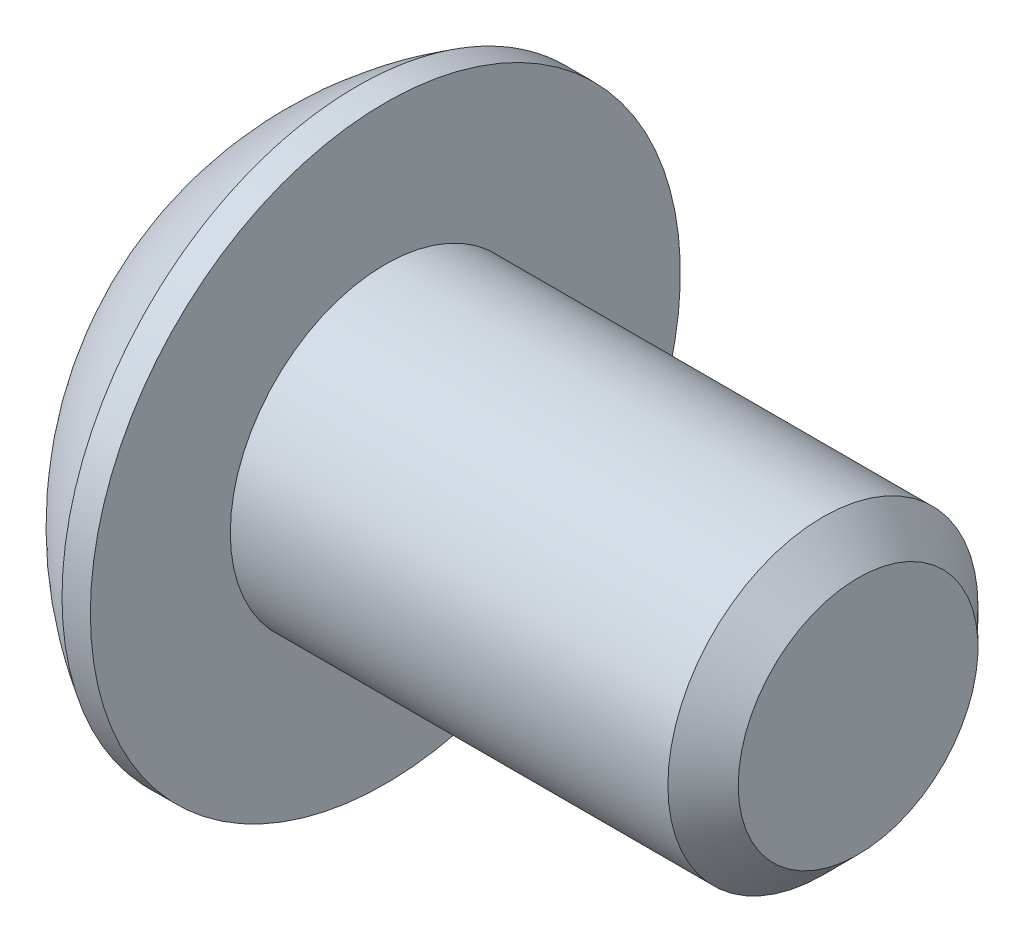
ISO-10303-21;
HEADER;
FILE_DESCRIPTION(('STEP AP214'),'2;1');
FILE_NAME('part.step','',(''),(''),'','','');
FILE_SCHEMA(('AUTOMOTIVE_DESIGN { 1 0 10303 214 1 1 1 1 }'));
ENDSEC;
DATA;
#1=APPLICATION_CONTEXT('core data for automotive mechanical design processes');
#2=APPLICATION_PROTOCOL_DEFINITION('international standard','automotive_design',2000,#1);
#3=PRODUCT_CONTEXT('',#1,'mechanical');
#4=PRODUCT('Part','Part','',(#3));
#5=PRODUCT_RELATED_PRODUCT_CATEGORY('part','',(#4));
#6=PRODUCT_DEFINITION_FORMATION('','',#4);
#7=PRODUCT_DEFINITION_CONTEXT('part definition',#1,'design');
#8=PRODUCT_DEFINITION('design','',#6,#7);
#9=PRODUCT_DEFINITION_SHAPE('','',#8);
#10=(LENGTH_UNIT() NAMED_UNIT(*) SI_UNIT(.MILLI.,.METRE.));
#11=(NAMED_UNIT(*) PLANE_ANGLE_UNIT() SI_UNIT($,.RADIAN.));
#12=(NAMED_UNIT(*) SI_UNIT($,.STERADIAN.) SOLID_ANGLE_UNIT());
#13=UNCERTAINTY_MEASURE_WITH_UNIT(LENGTH_MEASURE(1.E-05),#10,'distance_accuracy_value','');
#14=(GEOMETRIC_REPRESENTATION_CONTEXT(3) GLOBAL_UNCERTAINTY_ASSIGNED_CONTEXT((#13)) GLOBAL_UNIT_ASSIGNED_CONTEXT((#10,
#11,#12)) REPRESENTATION_CONTEXT('',''));
#15=CARTESIAN_POINT('',(0.,0.,0.));
#16=DIRECTION('',(0.,0.,1.));
#17=DIRECTION('',(1.,0.,0.));
#18=AXIS2_PLACEMENT_3D('',#15,#16,#17);
#19=CARTESIAN_POINT('',(1.32080000000034,0.,0.));
#20=DIRECTION('',(-1.,0.,0.));
#21=DIRECTION('',(0.,0.,1.));
#22=AXIS2_PLACEMENT_3D('',#19,#20,#21);
#23=CONICAL_SURFACE('',#22,1.1937999999998,1.04719755119608);
#24=CARTESIAN_POINT('',(2.01004075135902,0.,4.44089209850063E-13));
#25=VERTEX_POINT('',#24);
#26=VERTEX_LOOP('',#25);
#27=FACE_BOUND('',#26,.T.);
#28=CARTESIAN_POINT('',(1.32080000000009,0.,0.));
#29=DIRECTION('',(-1.,0.,0.));
#30=DIRECTION('',(0.,0.,1.));
#31=AXIS2_PLACEMENT_3D('',#28,#29,#30);
#32=CIRCLE('',#31,1.19380000000024);
#33=CARTESIAN_POINT('',(1.32080000000004,-1.03386112703797,0.59690000000006));
#34=VERTEX_POINT('',#33);
#35=CARTESIAN_POINT('',(1.32080000000004,0.,1.19380000000012));
#36=VERTEX_POINT('',#35);
#37=EDGE_CURVE('E19',#34,#36,#32,.T.);
#38=ORIENTED_EDGE('',*,*,#37,.T.);
#39=CARTESIAN_POINT('',(1.32080000000009,0.,0.));
#40=DIRECTION('',(-1.,0.,0.));
#41=DIRECTION('',(0.,0.,1.));
#42=AXIS2_PLACEMENT_3D('',#39,#40,#41);
#43=CIRCLE('',#42,1.19380000000024);
#44=CARTESIAN_POINT('',(1.32080000000004,1.03386112703797,0.596900000000061));
#45=VERTEX_POINT('',#44);
#46=EDGE_CURVE('E147',#36,#45,#43,.T.);
#47=ORIENTED_EDGE('',*,*,#46,.T.);
#48=CARTESIAN_POINT('',(1.32080000000009,0.,0.));
#49=DIRECTION('',(-1.,0.,0.));
#50=DIRECTION('',(0.,0.,1.));
#51=AXIS2_PLACEMENT_3D('',#48,#49,#50);
#52=CIRCLE('',#51,1.19380000000024);
#53=CARTESIAN_POINT('',(1.32080000000004,1.03386112703797,-0.596900000000061));
#54=VERTEX_POINT('',#53);
#55=EDGE_CURVE('E402',#45,#54,#52,.T.);
#56=ORIENTED_EDGE('',*,*,#55,.T.);
#57=CARTESIAN_POINT('',(1.32080000000009,0.,0.));
#58=DIRECTION('',(-1.,0.,0.));
#59=DIRECTION('',(0.,0.,1.));
#60=AXIS2_PLACEMENT_3D('',#57,#58,#59);
#61=CIRCLE('',#60,1.19380000000024);
#62=CARTESIAN_POINT('',(1.32080000000004,1.49457637585666E-12,-1.19380000000012));
#63=VERTEX_POINT('',#62);
#64=EDGE_CURVE('E403',#54,#63,#61,.T.);
#65=ORIENTED_EDGE('',*,*,#64,.T.);
#66=CARTESIAN_POINT('',(1.32080000000009,0.,0.));
#67=DIRECTION('',(-1.,0.,0.));
#68=DIRECTION('',(0.,0.,1.));
#69=AXIS2_PLACEMENT_3D('',#66,#67,#68);
#70=CIRCLE('',#69,1.19380000000024);
#71=CARTESIAN_POINT('',(1.32080000000004,-1.03386112703797,-0.59690000000006));
#72=VERTEX_POINT('',#71);
#73=EDGE_CURVE('E92',#63,#72,#70,.T.);
#74=ORIENTED_EDGE('',*,*,#73,.T.);
#75=CARTESIAN_POINT('',(1.32080000000009,0.,0.));
#76=DIRECTION('',(-1.,0.,0.));
#77=DIRECTION('',(0.,0.,1.));
#78=AXIS2_PLACEMENT_3D('',#75,#76,#77);
#79=CIRCLE('',#78,1.19380000000024);
#80=EDGE_CURVE('E88',#72,#34,#79,.T.);
#81=ORIENTED_EDGE('',*,*,#80,.T.);
#82=EDGE_LOOP('',(#38,#47,#56,#65,#74,#81));
#83=FACE_BOUND('',#82,.T.);
#84=ADVANCED_FACE('F16',(#27,#83),#23,.F.);
#85=CARTESIAN_POINT('',(1.3208,-2.06772225407572,-1.1938));
#86=DIRECTION('',(1.,0.,0.));
#87=DIRECTION('',(0.,0.,-1.));
#88=AXIS2_PLACEMENT_3D('',#85,#86,#87);
#89=PLANE('',#88);
#90=DIRECTION('',(0.,0.5,0.866025403784439));
#91=VECTOR('',#90,1.);
#92=CARTESIAN_POINT('',(1.3208,-1.37848150271715,0.));
#93=LINE('',#92,#91);
#94=CARTESIAN_POINT('',(1.3208,-0.689240751358574,1.1938));
#95=VERTEX_POINT('',#94);
#96=EDGE_CURVE('E100',#95,#34,#93,.F.);
#97=ORIENTED_EDGE('',*,*,#96,.F.);
#98=DIRECTION('',(0.,1.,0.));
#99=VECTOR('',#98,1.);
#100=CARTESIAN_POINT('',(1.3208,-0.689240751358574,1.1938));
#101=LINE('',#100,#99);
#102=EDGE_CURVE('E102',#36,#95,#101,.F.);
#103=ORIENTED_EDGE('',*,*,#102,.F.);
#104=ORIENTED_EDGE('',*,*,#37,.F.);
#105=EDGE_LOOP('',(#97,#103,#104));
#106=FACE_BOUND('',#105,.T.);
#107=ADVANCED_FACE('F98',(#106),#89,.F.);
#108=CARTESIAN_POINT('',(1.3208,-2.06772225407572,-1.1938));
#109=DIRECTION('',(1.,0.,0.));
#110=DIRECTION('',(0.,0.,-1.));
#111=AXIS2_PLACEMENT_3D('',#108,#109,#110);
#112=PLANE('',#111);
#113=DIRECTION('',(0.,-0.5,0.866025403784439));
#114=VECTOR('',#113,1.);
#115=CARTESIAN_POINT('',(1.3208,-0.689240751358574,-1.1938));
#116=LINE('',#115,#114);
#117=CARTESIAN_POINT('',(1.3208,-1.37848150271715,0.));
#118=VERTEX_POINT('',#117);
#119=EDGE_CURVE('E108',#118,#72,#116,.F.);
#120=ORIENTED_EDGE('',*,*,#119,.F.);
#121=DIRECTION('',(0.,0.5,0.866025403784439));
#122=VECTOR('',#121,1.);
#123=CARTESIAN_POINT('',(1.3208,-1.37848150271715,0.));
#124=LINE('',#123,#122);
#125=EDGE_CURVE('E105',#34,#118,#124,.F.);
#126=ORIENTED_EDGE('',*,*,#125,.F.);
#127=ORIENTED_EDGE('',*,*,#80,.F.);
#128=EDGE_LOOP('',(#120,#126,#127));
#129=FACE_BOUND('',#128,.T.);
#130=ADVANCED_FACE('F106',(#129),#112,.F.);
#131=CARTESIAN_POINT('',(1.3208,-2.06772225407572,-1.1938));
#132=DIRECTION('',(1.,0.,0.));
#133=DIRECTION('',(0.,0.,-1.));
#134=AXIS2_PLACEMENT_3D('',#131,#132,#133);
#135=PLANE('',#134);
#136=DIRECTION('',(0.,1.,0.));
#137=VECTOR('',#136,1.);
#138=CARTESIAN_POINT('',(1.3208,0.689240751358577,-1.1938));
#139=LINE('',#138,#137);
#140=CARTESIAN_POINT('',(1.3208,-0.689240751358574,-1.1938));
#141=VERTEX_POINT('',#140);
#142=EDGE_CURVE('E373',#141,#63,#139,.T.);
#143=ORIENTED_EDGE('',*,*,#142,.F.);
#144=DIRECTION('',(0.,-0.5,0.866025403784439));
#145=VECTOR('',#144,1.);
#146=CARTESIAN_POINT('',(1.3208,-0.689240751358574,-1.1938));
#147=LINE('',#146,#145);
#148=EDGE_CURVE('E385',#72,#141,#147,.F.);
#149=ORIENTED_EDGE('',*,*,#148,.F.);
#150=ORIENTED_EDGE('',*,*,#73,.F.);
#151=EDGE_LOOP('',(#143,#149,#150));
#152=FACE_BOUND('',#151,.T.);
#153=ADVANCED_FACE('F190',(#152),#135,.F.);
#154=CARTESIAN_POINT('',(1.3208,-2.06772225407572,-1.1938));
#155=DIRECTION('',(1.,0.,0.));
#156=DIRECTION('',(0.,0.,-1.));
#157=AXIS2_PLACEMENT_3D('',#154,#155,#156);
#158=PLANE('',#157);
#159=DIRECTION('',(0.,-0.5,-0.866025403784439));
#160=VECTOR('',#159,1.);
#161=CARTESIAN_POINT('',(1.3208,1.37848150271715,0.));
#162=LINE('',#161,#160);
#163=CARTESIAN_POINT('',(1.3208,0.689240751358577,-1.1938));
#164=VERTEX_POINT('',#163);
#165=EDGE_CURVE('E359',#164,#54,#162,.F.);
#166=ORIENTED_EDGE('',*,*,#165,.F.);
#167=DIRECTION('',(0.,1.,0.));
#168=VECTOR('',#167,1.);
#169=CARTESIAN_POINT('',(1.3208,0.689240751358577,-1.1938));
#170=LINE('',#169,#168);
#171=EDGE_CURVE('E370',#63,#164,#170,.T.);
#172=ORIENTED_EDGE('',*,*,#171,.F.);
#173=ORIENTED_EDGE('',*,*,#64,.F.);
#174=EDGE_LOOP('',(#166,#172,#173));
#175=FACE_BOUND('',#174,.T.);
#176=ADVANCED_FACE('F186',(#175),#158,.F.);
#177=CARTESIAN_POINT('',(1.3208,-2.06772225407572,-1.1938));
#178=DIRECTION('',(1.,0.,0.));
#179=DIRECTION('',(0.,0.,-1.));
#180=AXIS2_PLACEMENT_3D('',#177,#178,#179);
#181=PLANE('',#180);
#182=DIRECTION('',(0.,0.5,-0.866025403784439));
#183=VECTOR('',#182,1.);
#184=CARTESIAN_POINT('',(1.3208,0.689240751358576,1.1938));
#185=LINE('',#184,#183);
#186=CARTESIAN_POINT('',(1.3208,1.37848150271715,0.));
#187=VERTEX_POINT('',#186);
#188=EDGE_CURVE('E338',#187,#45,#185,.F.);
#189=ORIENTED_EDGE('',*,*,#188,.F.);
#190=DIRECTION('',(0.,-0.5,-0.866025403784439));
#191=VECTOR('',#190,1.);
#192=CARTESIAN_POINT('',(1.3208,1.37848150271715,0.));
#193=LINE('',#192,#191);
#194=EDGE_CURVE('E357',#54,#187,#193,.F.);
#195=ORIENTED_EDGE('',*,*,#194,.F.);
#196=ORIENTED_EDGE('',*,*,#55,.F.);
#197=EDGE_LOOP('',(#189,#195,#196));
#198=FACE_BOUND('',#197,.T.);
#199=ADVANCED_FACE('F182',(#198),#181,.F.);
#200=CARTESIAN_POINT('',(1.3208,-2.06772225407572,-1.1938));
#201=DIRECTION('',(1.,0.,0.));
#202=DIRECTION('',(0.,0.,-1.));
#203=AXIS2_PLACEMENT_3D('',#200,#201,#202);
#204=PLANE('',#203);
#205=DIRECTION('',(0.,1.,0.));
#206=VECTOR('',#205,1.);
#207=CARTESIAN_POINT('',(1.3208,-0.689240751358574,1.1938));
#208=LINE('',#207,#206);
#209=CARTESIAN_POINT('',(1.3208,0.689240751358576,1.1938));
#210=VERTEX_POINT('',#209);
#211=EDGE_CURVE('E117',#210,#36,#208,.F.);
#212=ORIENTED_EDGE('',*,*,#211,.F.);
#213=DIRECTION('',(0.,0.5,-0.866025403784439));
#214=VECTOR('',#213,1.);
#215=CARTESIAN_POINT('',(1.3208,0.689240751358576,1.1938));
#216=LINE('',#215,#214);
#217=EDGE_CURVE('E341',#45,#210,#216,.F.);
#218=ORIENTED_EDGE('',*,*,#217,.F.);
#219=ORIENTED_EDGE('',*,*,#46,.F.);
#220=EDGE_LOOP('',(#212,#218,#219));
#221=FACE_BOUND('',#220,.T.);
#222=ADVANCED_FACE('F178',(#221),#204,.F.);
#223=CARTESIAN_POINT('',(1.3208,-0.689240751358574,1.1938));
#224=DIRECTION('',(0.,0.,-1.));
#225=DIRECTION('',(0.,1.,0.));
#226=AXIS2_PLACEMENT_3D('',#223,#224,#225);
#227=PLANE('',#226);
#228=DIRECTION('',(0.,1.,0.));
#229=VECTOR('',#228,1.);
#230=CARTESIAN_POINT('',(0.,0.,1.1938));
#231=LINE('',#230,#229);
#232=CARTESIAN_POINT('',(0.,0.689240751358577,1.1938));
#233=VERTEX_POINT('',#232);
#234=CARTESIAN_POINT('',(0.,-0.689240751358574,1.1938));
#235=VERTEX_POINT('',#234);
#236=EDGE_CURVE('E335',#233,#235,#231,.F.);
#237=ORIENTED_EDGE('',*,*,#236,.F.);
#238=DIRECTION('',(1.,0.,0.));
#239=VECTOR('',#238,1.);
#240=CARTESIAN_POINT('',(1.3208,0.689240751358576,1.1938));
#241=LINE('',#240,#239);
#242=EDGE_CURVE('E347',#210,#233,#241,.F.);
#243=ORIENTED_EDGE('',*,*,#242,.F.);
#244=ORIENTED_EDGE('',*,*,#211,.T.);
#245=ORIENTED_EDGE('',*,*,#102,.T.);
#246=DIRECTION('',(1.,0.,0.));
#247=VECTOR('',#246,1.);
#248=CARTESIAN_POINT('',(1.3208,-0.689240751358574,1.1938));
#249=LINE('',#248,#247);
#250=EDGE_CURVE('E111',#235,#95,#249,.T.);
#251=ORIENTED_EDGE('',*,*,#250,.F.);
#252=EDGE_LOOP('',(#237,#243,#244,#245,#251));
#253=FACE_BOUND('',#252,.T.);
#254=ADVANCED_FACE('F175',(#253),#227,.T.);
#255=CARTESIAN_POINT('',(1.3208,-1.37848150271715,0.));
#256=DIRECTION('',(0.,0.866025403784439,-0.5));
#257=DIRECTION('',(0.,0.5,0.866025403784439));
#258=AXIS2_PLACEMENT_3D('',#255,#256,#257);
#259=PLANE('',#258);
#260=DIRECTION('',(0.,-0.5,-0.866025403784439));
#261=VECTOR('',#260,1.);
#262=CARTESIAN_POINT('',(0.,-0.689240751358574,1.1938));
#263=LINE('',#262,#261);
#264=CARTESIAN_POINT('',(0.,-1.37848150271715,0.));
#265=VERTEX_POINT('',#264);
#266=EDGE_CURVE('E332',#235,#265,#263,.T.);
#267=ORIENTED_EDGE('',*,*,#266,.F.);
#268=ORIENTED_EDGE('',*,*,#250,.T.);
#269=ORIENTED_EDGE('',*,*,#96,.T.);
#270=ORIENTED_EDGE('',*,*,#125,.T.);
#271=DIRECTION('',(1.,0.,0.));
#272=VECTOR('',#271,1.);
#273=CARTESIAN_POINT('',(1.3208,-1.37848150271715,0.));
#274=LINE('',#273,#272);
#275=EDGE_CURVE('E382',#265,#118,#274,.T.);
#276=ORIENTED_EDGE('',*,*,#275,.F.);
#277=EDGE_LOOP('',(#267,#268,#269,#270,#276));
#278=FACE_BOUND('',#277,.T.);
#279=ADVANCED_FACE('F115',(#278),#259,.T.);
#280=CARTESIAN_POINT('',(1.3208,-0.689240751358574,-1.1938));
#281=DIRECTION('',(0.,0.866025403784439,0.5));
#282=DIRECTION('',(0.,-0.5,0.866025403784439));
#283=AXIS2_PLACEMENT_3D('',#280,#281,#282);
#284=PLANE('',#283);
#285=DIRECTION('',(0.,0.5,-0.866025403784439));
#286=VECTOR('',#285,1.);
#287=CARTESIAN_POINT('',(0.,-1.37848150271715,0.));
#288=LINE('',#287,#286);
#289=CARTESIAN_POINT('',(0.,-0.689240751358574,-1.1938));
#290=VERTEX_POINT('',#289);
#291=EDGE_CURVE('E329',#265,#290,#288,.T.);
#292=ORIENTED_EDGE('',*,*,#291,.F.);
#293=ORIENTED_EDGE('',*,*,#275,.T.);
#294=ORIENTED_EDGE('',*,*,#119,.T.);
#295=ORIENTED_EDGE('',*,*,#148,.T.);
#296=DIRECTION('',(1.,0.,0.));
#297=VECTOR('',#296,1.);
#298=CARTESIAN_POINT('',(1.3208,-0.689240751358574,-1.1938));
#299=LINE('',#298,#297);
#300=EDGE_CURVE('E367',#290,#141,#299,.T.);
#301=ORIENTED_EDGE('',*,*,#300,.F.);
#302=EDGE_LOOP('',(#292,#293,#294,#295,#301));
#303=FACE_BOUND('',#302,.T.);
#304=ADVANCED_FACE('F168',(#303),#284,.T.);
#305=CARTESIAN_POINT('',(1.3208,0.689240751358577,-1.1938));
#306=DIRECTION('',(0.,0.,1.));
#307=DIRECTION('',(1.,0.,0.));
#308=AXIS2_PLACEMENT_3D('',#305,#306,#307);
#309=PLANE('',#308);
#310=DIRECTION('',(0.,1.,0.));
#311=VECTOR('',#310,1.);
#312=CARTESIAN_POINT('',(0.,0.,-1.1938));
#313=LINE('',#312,#311);
#314=CARTESIAN_POINT('',(0.,0.689240751358577,-1.1938));
#315=VERTEX_POINT('',#314);
#316=EDGE_CURVE('E326',#290,#315,#313,.T.);
#317=ORIENTED_EDGE('',*,*,#316,.F.);
#318=ORIENTED_EDGE('',*,*,#300,.T.);
#319=ORIENTED_EDGE('',*,*,#142,.T.);
#320=ORIENTED_EDGE('',*,*,#171,.T.);
#321=DIRECTION('',(1.,0.,0.));
#322=VECTOR('',#321,1.);
#323=CARTESIAN_POINT('',(1.3208,0.689240751358577,-1.1938));
#324=LINE('',#323,#322);
#325=EDGE_CURVE('E342',#315,#164,#324,.T.);
#326=ORIENTED_EDGE('',*,*,#325,.F.);
#327=EDGE_LOOP('',(#317,#318,#319,#320,#326));
#328=FACE_BOUND('',#327,.T.);
#329=ADVANCED_FACE('F165',(#328),#309,.T.);
#330=CARTESIAN_POINT('',(1.3208,1.37848150271715,0.));
#331=DIRECTION('',(0.,-0.866025403784439,0.5));
#332=DIRECTION('',(0.,-0.5,-0.866025403784439));
#333=AXIS2_PLACEMENT_3D('',#330,#331,#332);
#334=PLANE('',#333);
#335=DIRECTION('',(0.,0.5,0.866025403784439));
#336=VECTOR('',#335,1.);
#337=CARTESIAN_POINT('',(0.,0.689240751358577,-1.1938));
#338=LINE('',#337,#336);
#339=CARTESIAN_POINT('',(0.,1.37848150271715,0.));
#340=VERTEX_POINT('',#339);
#341=EDGE_CURVE('E323',#315,#340,#338,.T.);
#342=ORIENTED_EDGE('',*,*,#341,.F.);
#343=ORIENTED_EDGE('',*,*,#325,.T.);
#344=ORIENTED_EDGE('',*,*,#165,.T.);
#345=ORIENTED_EDGE('',*,*,#194,.T.);
#346=DIRECTION('',(1.,0.,0.));
#347=VECTOR('',#346,1.);
#348=CARTESIAN_POINT('',(1.3208,1.37848150271715,0.));
#349=LINE('',#348,#347);
#350=EDGE_CURVE('E34',#340,#187,#349,.T.);
#351=ORIENTED_EDGE('',*,*,#350,.F.);
#352=EDGE_LOOP('',(#342,#343,#344,#345,#351));
#353=FACE_BOUND('',#352,.T.);
#354=ADVANCED_FACE('F161',(#353),#334,.T.);
#355=CARTESIAN_POINT('',(1.3208,0.689240751358576,1.1938));
#356=DIRECTION('',(0.,-0.866025403784439,-0.5));
#357=DIRECTION('',(0.,0.5,-0.866025403784439));
#358=AXIS2_PLACEMENT_3D('',#355,#356,#357);
#359=PLANE('',#358);
#360=DIRECTION('',(0.,-0.5,0.866025403784439));
#361=VECTOR('',#360,1.);
#362=CARTESIAN_POINT('',(0.,1.37848150271715,0.));
#363=LINE('',#362,#361);
#364=EDGE_CURVE('E146',#340,#233,#363,.T.);
#365=ORIENTED_EDGE('',*,*,#364,.F.);
#366=ORIENTED_EDGE('',*,*,#350,.T.);
#367=ORIENTED_EDGE('',*,*,#188,.T.);
#368=ORIENTED_EDGE('',*,*,#217,.T.);
#369=ORIENTED_EDGE('',*,*,#242,.T.);
#370=EDGE_LOOP('',(#365,#366,#367,#368,#369));
#371=FACE_BOUND('',#370,.T.);
#372=ADVANCED_FACE('F157',(#371),#359,.T.);
#373=CARTESIAN_POINT('',(0.,0.,0.));
#374=DIRECTION('',(-1.,0.,0.));
#375=DIRECTION('',(0.,0.,1.));
#376=AXIS2_PLACEMENT_3D('',#373,#374,#375);
#377=PLANE('',#376);
#378=ORIENTED_EDGE('',*,*,#341,.T.);
#379=ORIENTED_EDGE('',*,*,#364,.T.);
#380=ORIENTED_EDGE('',*,*,#236,.T.);
#381=ORIENTED_EDGE('',*,*,#266,.T.);
#382=ORIENTED_EDGE('',*,*,#291,.T.);
#383=ORIENTED_EDGE('',*,*,#316,.T.);
#384=EDGE_LOOP('',(#378,#379,#380,#381,#382,#383));
#385=FACE_BOUND('',#384,.T.);
#386=CARTESIAN_POINT('',(0.,1.9812,0.));
#387=CARTESIAN_POINT('',(0.,1.9811996664299,0.0556258831179428));
#388=CARTESIAN_POINT('',(0.,1.97885520380442,0.111261989398606));
#389=CARTESIAN_POINT('',(0.,1.96949260169541,0.222149719830458));
#390=CARTESIAN_POINT('',(0.,1.96247308239605,0.277401225602895));
#391=CARTESIAN_POINT('',(0.,1.94379192841038,0.387209508139747));
#392=CARTESIAN_POINT('',(-1.85325793235264E-13,1.93212292489526,0.441765039546365));
#393=CARTESIAN_POINT('',(1.86344214223505E-13,1.90422331175315,0.549729449347493));
#394=CARTESIAN_POINT('',(6.94543371897454E-13,1.88798900035338,0.603137359208869));
#395=CARTESIAN_POINT('',(1.15501975216981E-12,1.83266214476501,0.760839131321828));
#396=CARTESIAN_POINT('',(0.,1.78690023648845,0.862876433575429));
#397=CARTESIAN_POINT('',(0.,1.67887358150667,1.05780719540872));
#398=CARTESIAN_POINT('',(9.54193214892627E-13,1.6166082074585,1.15070030720801));
#399=CARTESIAN_POINT('',(5.94805591894675E-13,1.51224157140982,1.28116890915697));
#400=CARTESIAN_POINT('',(1.63221293851378E-13,1.4755970394354,1.32320451127026));
#401=CARTESIAN_POINT('',(-1.62196980336157E-13,1.39893832619713,1.40400288695709));
#402=CARTESIAN_POINT('',(0.,1.35892742784698,1.44276877695455));
#403=CARTESIAN_POINT('',(1.14362537325405E-13,1.23416504602197,1.55382272417904));
#404=CARTESIAN_POINT('',(0.,1.14466125559859,1.62089527952111));
#405=CARTESIAN_POINT('',(0.,0.955712144178167,1.7390221808118));
#406=CARTESIAN_POINT('',(0.,0.856267198233564,1.79007713076007));
#407=CARTESIAN_POINT('',(0.,0.650206345910843,1.87477637530954));
#408=CARTESIAN_POINT('',(0.,0.543590516134855,1.90842085586267));
#409=CARTESIAN_POINT('',(0.,0.326226155292018,1.95733039300656));
#410=CARTESIAN_POINT('',(0.,0.21547760215793,1.97259535144288));
#411=CARTESIAN_POINT('',(0.,-0.00701040587544639,1.98431697865418));
#412=CARTESIAN_POINT('',(0.,-0.118749860774734,1.98077364742917));
#413=CARTESIAN_POINT('',(0.,-0.340050178355485,1.95497485623825));
#414=CARTESIAN_POINT('',(0.,-0.449611052668255,1.93271949620218));
#415=CARTESIAN_POINT('',(0.,-0.663431110729174,1.87014138774523));
#416=CARTESIAN_POINT('',(0.,-0.76769023783852,1.82981844635272));
#417=CARTESIAN_POINT('',(0.,-0.968005760719347,1.73219968377096));
#418=CARTESIAN_POINT('',(0.,-1.0640618469811,1.6749032225164));
#419=CARTESIAN_POINT('',(0.,-1.19980276751283,1.57757371205873));
#420=CARTESIAN_POINT('',(0.,-1.24366557129213,1.54322665019466));
#421=CARTESIAN_POINT('',(0.,-1.32838995706696,1.47093063174264));
#422=CARTESIAN_POINT('',(0.,-1.36924860178706,1.43297823102439));
#423=CARTESIAN_POINT('',(0.,-1.48674671849223,1.31419842051173));
#424=CARTESIAN_POINT('',(0.,-1.55842832343237,1.22836221289311));
#425=CARTESIAN_POINT('',(0.,-1.6863396856475,1.04586168272493));
#426=CARTESIAN_POINT('',(0.,-1.7425700302488,0.949197771949774));
#427=CARTESIAN_POINT('',(0.,-1.8141614250401,0.798182600298684));
#428=CARTESIAN_POINT('',(0.,-1.83591780585875,0.746776203847791));
#429=CARTESIAN_POINT('',(0.,-1.87500754181092,0.642341081688636));
#430=CARTESIAN_POINT('',(0.,-1.89234447645404,0.589313708122847));
#431=CARTESIAN_POINT('',(0.,-1.92246053433554,0.482076273028395));
#432=CARTESIAN_POINT('',(0.,-1.93524685475118,0.42786822425751));
#433=CARTESIAN_POINT('',(0.,-1.95620937250494,0.318578151844611));
#434=CARTESIAN_POINT('',(0.,-1.96438692958147,0.263496390912872));
#435=CARTESIAN_POINT('',(0.,-1.97388528284653,0.173607715038558));
#436=CARTESIAN_POINT('',(0.,-1.97662743364426,0.138944718024998));
#437=CARTESIAN_POINT('',(0.,-1.98028489645283,0.0695224782567002));
#438=CARTESIAN_POINT('',(0.,-1.98120020846367,0.0347632355019631));
#439=CARTESIAN_POINT('',(0.,-1.9811996664299,-0.0556258831179437));
#440=CARTESIAN_POINT('',(0.,-1.97885520380442,-0.111261989398607));
#441=CARTESIAN_POINT('',(0.,-1.96949260169541,-0.222149719830459));
#442=CARTESIAN_POINT('',(0.,-1.96247308239605,-0.277401225602897));
#443=CARTESIAN_POINT('',(0.,-1.94379192841039,-0.387209508139749));
#444=CARTESIAN_POINT('',(-1.85269749640691E-13,-1.93212292489526,-0.441765039546367));
#445=CARTESIAN_POINT('',(1.86288125054388E-13,-1.90422331175315,-0.549729449347495));
#446=CARTESIAN_POINT('',(6.94525090263764E-13,-1.88798900035338,-0.603137359208872));
#447=CARTESIAN_POINT('',(1.15505622829081E-12,-1.83266214476501,-0.760839131321831));
#448=CARTESIAN_POINT('',(0.,-1.78690023648845,-0.862876433575431));
#449=CARTESIAN_POINT('',(0.,-1.67887358150667,-1.05780719540872));
#450=CARTESIAN_POINT('',(9.54248812869379E-13,-1.6166082074585,-1.15070030720801));
#451=CARTESIAN_POINT('',(5.94777756479239E-13,-1.51224157140982,-1.28116890915698));
#452=CARTESIAN_POINT('',(1.63138949183833E-13,-1.47559703943539,-1.32320451127027));
#453=CARTESIAN_POINT('',(-1.62114715061273E-13,-1.39893832619713,-1.40400288695709));
#454=CARTESIAN_POINT('',(0.,-1.35892742784699,-1.44276877695455));
#455=CARTESIAN_POINT('',(1.13760489124207E-13,-1.23416504602197,-1.55382272417904));
#456=CARTESIAN_POINT('',(0.,-1.14466125559859,-1.62089527952111));
#457=CARTESIAN_POINT('',(0.,-0.95571214417816,-1.73902218081179));
#458=CARTESIAN_POINT('',(0.,-0.856267198233559,-1.79007713076007));
#459=CARTESIAN_POINT('',(0.,-0.650206345910841,-1.87477637530954));
#460=CARTESIAN_POINT('',(0.,-0.543590516134854,-1.90842085586267));
#461=CARTESIAN_POINT('',(0.,-0.326226155292018,-1.95733039300657));
#462=CARTESIAN_POINT('',(0.,-0.215477602157929,-1.97259535144288));
#463=CARTESIAN_POINT('',(0.,0.0070104058754487,-1.98431697865418));
#464=CARTESIAN_POINT('',(0.,0.118749860774737,-1.98077364742916));
#465=CARTESIAN_POINT('',(0.,0.340050178355489,-1.95497485623824));
#466=CARTESIAN_POINT('',(0.,0.44961105266826,-1.93271949620218));
#467=CARTESIAN_POINT('',(0.,0.663431110729178,-1.87014138774524));
#468=CARTESIAN_POINT('',(0.,0.767690237838524,-1.82981844635272));
#469=CARTESIAN_POINT('',(0.,0.968005760719348,-1.73219968377096));
#470=CARTESIAN_POINT('',(0.,1.0640618469811,-1.67490322251639));
#471=CARTESIAN_POINT('',(0.,1.19980276751283,-1.57757371205873));
#472=CARTESIAN_POINT('',(0.,1.24366557129214,-1.54322665019465));
#473=CARTESIAN_POINT('',(0.,1.32838995706696,-1.47093063174263));
#474=CARTESIAN_POINT('',(0.,1.36924860178706,-1.43297823102439));
#475=CARTESIAN_POINT('',(0.,1.48674671849223,-1.31419842051172));
#476=CARTESIAN_POINT('',(0.,1.55842832343237,-1.22836221289311));
#477=CARTESIAN_POINT('',(0.,1.6863396856475,-1.04586168272492));
#478=CARTESIAN_POINT('',(0.,1.7425700302488,-0.949197771949768));
#479=CARTESIAN_POINT('',(0.,1.8141614250401,-0.798182600298677));
#480=CARTESIAN_POINT('',(0.,1.83591780585875,-0.746776203847785));
#481=CARTESIAN_POINT('',(0.,1.87500754181092,-0.64234108168863));
#482=CARTESIAN_POINT('',(0.,1.89234447645404,-0.589313708122841));
#483=CARTESIAN_POINT('',(0.,1.92246053433555,-0.482076273028389));
#484=CARTESIAN_POINT('',(0.,1.93524685475118,-0.427868224257505));
#485=CARTESIAN_POINT('',(0.,1.95620937250494,-0.318578151844605));
#486=CARTESIAN_POINT('',(0.,1.96438692958147,-0.263496390912866));
#487=CARTESIAN_POINT('',(0.,1.97388528284653,-0.173607715038553));
#488=CARTESIAN_POINT('',(0.,1.97662743364426,-0.138944718024994));
#489=CARTESIAN_POINT('',(0.,1.98028489645283,-0.0695224782566989));
#490=CARTESIAN_POINT('',(0.,1.98120020846367,-0.034763235501963));
#491=CARTESIAN_POINT('',(0.,1.9812,0.));
#492=B_SPLINE_CURVE_WITH_KNOTS('',3,(#386,#387,#388,#389,#390,#391,#392,#393,#394,#395,#396,
#397,#398,#399,#400,#401,#402,#403,#404,#405,#406,#407,#408,#409,#410,#411,#412,#413,#414,#415,
#416,#417,#418,#419,#420,#421,#422,#423,#424,#425,#426,#427,#428,#429,#430,#431,#432,#433,#434,
#435,#436,#437,#438,#439,#440,#441,#442,#443,#444,#445,#446,#447,#448,#449,#450,#451,#452,#453,
#454,#455,#456,#457,#458,#459,#460,#461,#462,#463,#464,#465,#466,#467,#468,#469,#470,#471,#472,
#473,#474,#475,#476,#477,#478,#479,#480,#481,#482,#483,#484,#485,#486,#487,#488,#489,#490,#491),
.UNSPECIFIED.,.T.,.F.,(4,2,2,2,2,2,2,2,2,2,2,2,2,2,2,2,2,2,2,2,2,2,2,2,2,2,2,2,2,2,2,2,2,2,2,2,
2,2,2,2,2,2,2,2,2,2,2,2,2,2,2,2,4),(0.,0.166845646007828,0.333740557374255,0.500901034367693,
0.668197445942386,1.00199278686282,1.33580081809885,1.50292354032982,1.6698851310853,
2.00370118900129,2.33750465770544,2.67130456115909,3.005106247238,3.33890793331696,
3.67270783677065,4.00651130547476,4.34032736339026,4.50728895414554,4.67441167637632,
5.00821970761259,5.34201504853332,5.50931146010827,5.67647193710191,5.84336684846844,
6.0102124944764,6.11448220058334,6.21875190669029,6.38559755269812,6.55249246406454,
6.71965294105798,6.88694935263268,7.22074469355311,7.55455272478915,7.72167544702011,
7.88863703777559,8.22245309569158,8.55625656439573,8.89005646784938,9.2238581539283,
9.55765984000725,9.89145974346094,10.2252632121651,10.5590792700806,10.7260408608358,
10.8931635830666,11.2269716143029,11.5607669552236,11.7280633667986,11.8952238437922,
12.0621187551587,12.2289644011667,12.3332341072736,12.4375038133806),.UNSPECIFIED.);
#493=CARTESIAN_POINT('',(0.,1.9812,0.));
#494=VERTEX_POINT('',#493);
#495=EDGE_CURVE('E139',#494,#494,#492,.T.);
#496=ORIENTED_EDGE('',*,*,#495,.F.);
#497=EDGE_LOOP('',(#496));
#498=FACE_BOUND('',#497,.T.);
#499=ADVANCED_FACE('F153',(#385,#498),#377,.T.);
#500=CARTESIAN_POINT('',(4.13385,0.,0.));
#501=DIRECTION('',(0.,1.,0.));
#502=DIRECTION('',(1.,0.,0.));
#503=AXIS2_PLACEMENT_3D('',#500,#501,#502);
#504=SPHERICAL_SURFACE('',#503,4.58408870578439);
#505=CARTESIAN_POINT('',(1.8288,0.,0.));
#506=DIRECTION('',(-1.,0.,0.));
#507=DIRECTION('',(0.,0.,1.));
#508=AXIS2_PLACEMENT_3D('',#505,#506,#507);
#509=CIRCLE('',#508,3.9624);
#510=CARTESIAN_POINT('',(1.8288,0.,3.9624));
#511=VERTEX_POINT('',#510);
#512=EDGE_CURVE('E136',#511,#511,#509,.F.);
#513=ORIENTED_EDGE('',*,*,#512,.F.);
#514=EDGE_LOOP('',(#513));
#515=FACE_BOUND('',#514,.T.);
#516=ORIENTED_EDGE('',*,*,#495,.T.);
#517=EDGE_LOOP('',(#516));
#518=FACE_BOUND('',#517,.T.);
#519=ADVANCED_FACE('F149',(#515,#518),#504,.T.);
#520=CARTESIAN_POINT('',(8.5598,0.,0.));
#521=DIRECTION('',(-1.,0.,0.));
#522=DIRECTION('',(0.,0.,1.));
#523=AXIS2_PLACEMENT_3D('',#520,#521,#522);
#524=PLANE('',#523);
#525=CARTESIAN_POINT('',(8.55979999994361,0.,0.));
#526=DIRECTION('',(-1.,0.,0.));
#527=DIRECTION('',(0.,0.,1.));
#528=AXIS2_PLACEMENT_3D('',#525,#526,#527);
#529=CIRCLE('',#528,1.61036000002923);
#530=CARTESIAN_POINT('',(8.55979999994361,0.,1.61036000002923));
#531=VERTEX_POINT('',#530);
#532=EDGE_CURVE('E133',#531,#531,#529,.T.);
#533=ORIENTED_EDGE('',*,*,#532,.F.);
#534=EDGE_LOOP('',(#533));
#535=FACE_BOUND('',#534,.T.);
#536=ADVANCED_FACE('F220',(#535),#524,.F.);
#537=CARTESIAN_POINT('',(0.,0.,0.));
#538=DIRECTION('',(-1.,0.,0.));
#539=DIRECTION('',(0.,0.,1.));
#540=AXIS2_PLACEMENT_3D('',#537,#538,#539);
#541=CYLINDRICAL_SURFACE('',#540,3.9624);
#542=ORIENTED_EDGE('',*,*,#512,.T.);
#543=EDGE_LOOP('',(#542));
#544=FACE_BOUND('',#543,.T.);
#545=CARTESIAN_POINT('',(2.2098,0.,0.));
#546=DIRECTION('',(-1.,0.,0.));
#547=DIRECTION('',(0.,0.,1.));
#548=AXIS2_PLACEMENT_3D('',#545,#546,#547);
#549=CIRCLE('',#548,3.9624);
#550=CARTESIAN_POINT('',(2.2098,0.,3.9624));
#551=VERTEX_POINT('',#550);
#552=EDGE_CURVE('E130',#551,#551,#549,.T.);
#553=ORIENTED_EDGE('',*,*,#552,.T.);
#554=EDGE_LOOP('',(#553));
#555=FACE_BOUND('',#554,.T.);
#556=ADVANCED_FACE('F217',(#544,#555),#541,.T.);
#557=CARTESIAN_POINT('',(8.0873599999336,0.,0.));
#558=DIRECTION('',(-1.,0.,0.));
#559=DIRECTION('',(0.,0.,1.));
#560=AXIS2_PLACEMENT_3D('',#557,#558,#559);
#561=CONICAL_SURFACE('',#560,2.08280000003924,0.785398163397448);
#562=CARTESIAN_POINT('',(8.08736,0.,0.));
#563=DIRECTION('',(-1.,0.,0.));
#564=DIRECTION('',(0.,0.,1.));
#565=AXIS2_PLACEMENT_3D('',#562,#563,#564);
#566=CIRCLE('',#565,2.0828);
#567=CARTESIAN_POINT('',(8.08736,0.,2.0828));
#568=VERTEX_POINT('',#567);
#569=EDGE_CURVE('E25',#568,#568,#566,.T.);
#570=ORIENTED_EDGE('',*,*,#569,.F.);
#571=EDGE_LOOP('',(#570));
#572=FACE_BOUND('',#571,.T.);
#573=ORIENTED_EDGE('',*,*,#532,.T.);
#574=EDGE_LOOP('',(#573));
#575=FACE_BOUND('',#574,.T.);
#576=ADVANCED_FACE('F210',(#572,#575),#561,.T.);
#577=CARTESIAN_POINT('',(2.2098,2.0828,0.));
#578=DIRECTION('',(-1.,0.,0.));
#579=DIRECTION('',(0.,0.,1.));
#580=AXIS2_PLACEMENT_3D('',#577,#578,#579);
#581=PLANE('',#580);
#582=CARTESIAN_POINT('',(2.2098,0.,0.));
#583=DIRECTION('',(-1.,0.,0.));
#584=DIRECTION('',(0.,0.,1.));
#585=AXIS2_PLACEMENT_3D('',#582,#583,#584);
#586=CIRCLE('',#585,2.0828);
#587=CARTESIAN_POINT('',(2.2098,0.,2.0828));
#588=VERTEX_POINT('',#587);
#589=EDGE_CURVE('E10',#588,#588,#586,.F.);
#590=ORIENTED_EDGE('',*,*,#589,.F.);
#591=EDGE_LOOP('',(#590));
#592=FACE_BOUND('',#591,.T.);
#593=ORIENTED_EDGE('',*,*,#552,.F.);
#594=EDGE_LOOP('',(#593));
#595=FACE_BOUND('',#594,.T.);
#596=ADVANCED_FACE('F204',(#592,#595),#581,.F.);
#597=CARTESIAN_POINT('',(0.,0.,0.));
#598=DIRECTION('',(-1.,0.,0.));
#599=DIRECTION('',(0.,0.,1.));
#600=AXIS2_PLACEMENT_3D('',#597,#598,#599);
#601=CYLINDRICAL_SURFACE('',#600,2.0828);
#602=ORIENTED_EDGE('',*,*,#589,.T.);
#603=EDGE_LOOP('',(#602));
#604=FACE_BOUND('',#603,.T.);
#605=ORIENTED_EDGE('',*,*,#569,.T.);
#606=EDGE_LOOP('',(#605));
#607=FACE_BOUND('',#606,.T.);
#608=ADVANCED_FACE('F202',(#604,#607),#601,.T.);
#609=CLOSED_SHELL('',(#84,#107,#130,#153,#176,#199,#222,#254,#279,#304,#329,#354,#372,#499,#519,
#536,#556,#576,#596,#608));
#610=MANIFOLD_SOLID_BREP('B1',#609);
#611=ADVANCED_BREP_SHAPE_REPRESENTATION('',(#18,#610),#14);
#612=SHAPE_DEFINITION_REPRESENTATION(#9,#611);
ENDSEC;
END-ISO-10303-21;
